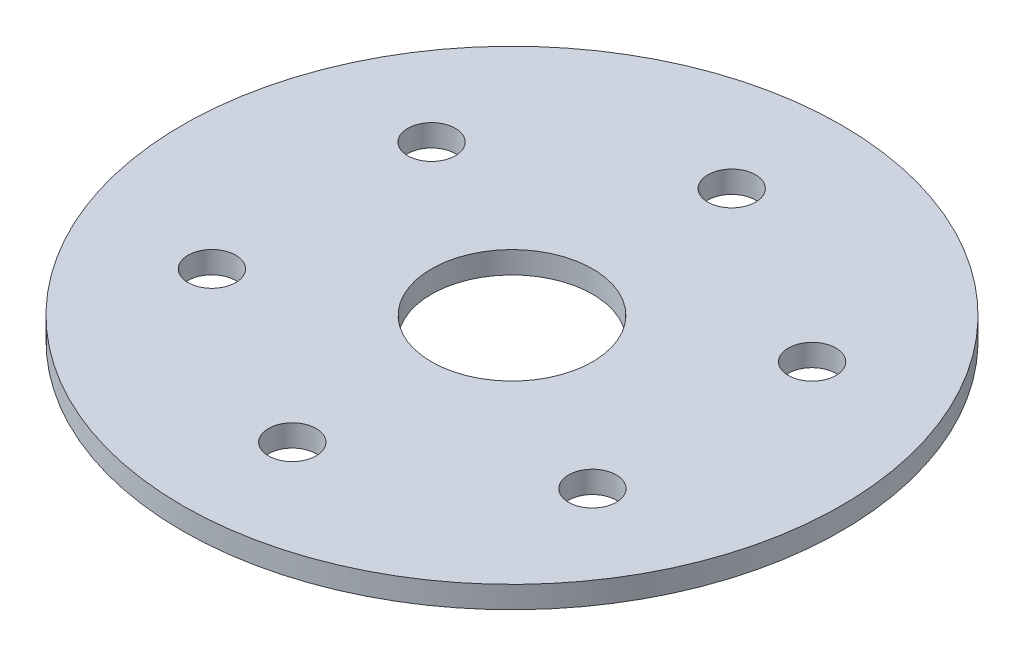
ISO-10303-21;
HEADER;
FILE_DESCRIPTION(('STEP AP214'),'2;1');
FILE_NAME('part.step','',(''),(''),'','','');
FILE_SCHEMA(('AUTOMOTIVE_DESIGN { 1 0 10303 214 1 1 1 1 }'));
ENDSEC;
DATA;
#1=APPLICATION_CONTEXT('core data for automotive mechanical design processes');
#2=APPLICATION_PROTOCOL_DEFINITION('international standard','automotive_design',2000,#1);
#3=PRODUCT_CONTEXT('',#1,'mechanical');
#4=PRODUCT('Part','Part','',(#3));
#5=PRODUCT_RELATED_PRODUCT_CATEGORY('part','',(#4));
#6=PRODUCT_DEFINITION_FORMATION('','',#4);
#7=PRODUCT_DEFINITION_CONTEXT('part definition',#1,'design');
#8=PRODUCT_DEFINITION('design','',#6,#7);
#9=PRODUCT_DEFINITION_SHAPE('','',#8);
#10=(LENGTH_UNIT() NAMED_UNIT(*) SI_UNIT(.MILLI.,.METRE.));
#11=(NAMED_UNIT(*) PLANE_ANGLE_UNIT() SI_UNIT($,.RADIAN.));
#12=(NAMED_UNIT(*) SI_UNIT($,.STERADIAN.) SOLID_ANGLE_UNIT());
#13=UNCERTAINTY_MEASURE_WITH_UNIT(LENGTH_MEASURE(1.E-05),#10,'distance_accuracy_value','');
#14=(GEOMETRIC_REPRESENTATION_CONTEXT(3) GLOBAL_UNCERTAINTY_ASSIGNED_CONTEXT((#13)) GLOBAL_UNIT_ASSIGNED_CONTEXT((#10,
#11,#12)) REPRESENTATION_CONTEXT('',''));
#15=CARTESIAN_POINT('',(0.,0.,0.));
#16=DIRECTION('',(0.,0.,1.));
#17=DIRECTION('',(1.,0.,0.));
#18=AXIS2_PLACEMENT_3D('',#15,#16,#17);
#19=CARTESIAN_POINT('',(0.,3.,0.));
#20=DIRECTION('',(0.,1.,0.));
#21=DIRECTION('',(0.,0.,1.));
#22=AXIS2_PLACEMENT_3D('',#19,#20,#21);
#23=PLANE('',#22);
#24=CARTESIAN_POINT('',(-25.9807621135298,3.,-14.9999999999941));
#25=DIRECTION('',(0.,1.,0.));
#26=DIRECTION('',(0.,0.,1.));
#27=AXIS2_PLACEMENT_3D('',#24,#25,#26);
#28=CIRCLE('',#27,3.25);
#29=CARTESIAN_POINT('',(-25.9807621135298,3.,-11.7499999999941));
#30=VERTEX_POINT('',#29);
#31=EDGE_CURVE('E79',#30,#30,#28,.T.);
#32=ORIENTED_EDGE('',*,*,#31,.F.);
#33=EDGE_LOOP('',(#32));
#34=FACE_BOUND('',#33,.T.);
#35=CARTESIAN_POINT('',(-25.9807621135229,3.,15.0000000000059));
#36=DIRECTION('',(0.,1.,0.));
#37=DIRECTION('',(0.,0.,1.));
#38=AXIS2_PLACEMENT_3D('',#35,#36,#37);
#39=CIRCLE('',#38,3.25);
#40=CARTESIAN_POINT('',(-25.9807621135229,3.,18.2500000000059));
#41=VERTEX_POINT('',#40);
#42=EDGE_CURVE('E73',#41,#41,#39,.T.);
#43=ORIENTED_EDGE('',*,*,#42,.F.);
#44=EDGE_LOOP('',(#43));
#45=FACE_BOUND('',#44,.T.);
#46=CARTESIAN_POINT('',(1.36020071822221E-11,3.,30.));
#47=DIRECTION('',(0.,1.,0.));
#48=DIRECTION('',(0.,0.,1.));
#49=AXIS2_PLACEMENT_3D('',#46,#47,#48);
#50=CIRCLE('',#49,3.25);
#51=CARTESIAN_POINT('',(1.36020071822221E-11,3.,33.25));
#52=VERTEX_POINT('',#51);
#53=EDGE_CURVE('E67',#52,#52,#50,.T.);
#54=ORIENTED_EDGE('',*,*,#53,.F.);
#55=EDGE_LOOP('',(#54));
#56=FACE_BOUND('',#55,.T.);
#57=CARTESIAN_POINT('',(25.9807621135434,3.,14.9999999999941));
#58=DIRECTION('',(0.,1.,0.));
#59=DIRECTION('',(0.,0.,1.));
#60=AXIS2_PLACEMENT_3D('',#57,#58,#59);
#61=CIRCLE('',#60,3.25);
#62=CARTESIAN_POINT('',(25.9807621135434,3.,18.2499999999941));
#63=VERTEX_POINT('',#62);
#64=EDGE_CURVE('E61',#63,#63,#61,.T.);
#65=ORIENTED_EDGE('',*,*,#64,.F.);
#66=EDGE_LOOP('',(#65));
#67=FACE_BOUND('',#66,.T.);
#68=CARTESIAN_POINT('',(25.9807621135365,3.,-15.0000000000059));
#69=DIRECTION('',(0.,1.,0.));
#70=DIRECTION('',(0.,0.,1.));
#71=AXIS2_PLACEMENT_3D('',#68,#69,#70);
#72=CIRCLE('',#71,3.25);
#73=CARTESIAN_POINT('',(25.9807621135365,3.,-11.7500000000059));
#74=VERTEX_POINT('',#73);
#75=EDGE_CURVE('E55',#74,#74,#72,.T.);
#76=ORIENTED_EDGE('',*,*,#75,.F.);
#77=EDGE_LOOP('',(#76));
#78=FACE_BOUND('',#77,.T.);
#79=CARTESIAN_POINT('',(0.,3.,-30.));
#80=DIRECTION('',(0.,1.,0.));
#81=DIRECTION('',(0.,0.,1.));
#82=AXIS2_PLACEMENT_3D('',#79,#80,#81);
#83=CIRCLE('',#82,3.25);
#84=CARTESIAN_POINT('',(0.,3.,-26.75));
#85=VERTEX_POINT('',#84);
#86=EDGE_CURVE('E49',#85,#85,#83,.T.);
#87=ORIENTED_EDGE('',*,*,#86,.F.);
#88=EDGE_LOOP('',(#87));
#89=FACE_BOUND('',#88,.T.);
#90=CARTESIAN_POINT('',(0.,3.,0.));
#91=DIRECTION('',(0.,1.,0.));
#92=DIRECTION('',(0.,0.,1.));
#93=AXIS2_PLACEMENT_3D('',#90,#91,#92);
#94=CIRCLE('',#93,45.);
#95=CARTESIAN_POINT('',(0.,3.,45.));
#96=VERTEX_POINT('',#95);
#97=EDGE_CURVE('E10',#96,#96,#94,.T.);
#98=ORIENTED_EDGE('',*,*,#97,.T.);
#99=EDGE_LOOP('',(#98));
#100=FACE_BOUND('',#99,.T.);
#101=CARTESIAN_POINT('',(0.,3.,0.));
#102=DIRECTION('',(0.,1.,0.));
#103=DIRECTION('',(0.,0.,1.));
#104=AXIS2_PLACEMENT_3D('',#101,#102,#103);
#105=CIRCLE('',#104,11.);
#106=CARTESIAN_POINT('',(0.,3.,11.));
#107=VERTEX_POINT('',#106);
#108=EDGE_CURVE('E41',#107,#107,#105,.T.);
#109=ORIENTED_EDGE('',*,*,#108,.F.);
#110=EDGE_LOOP('',(#109));
#111=FACE_BOUND('',#110,.T.);
#112=ADVANCED_FACE('F30',(#34,#45,#56,#67,#78,#89,#100,#111),#23,.T.);
#113=CARTESIAN_POINT('',(0.,0.,0.));
#114=DIRECTION('',(0.,1.,0.));
#115=DIRECTION('',(0.,0.,1.));
#116=AXIS2_PLACEMENT_3D('',#113,#114,#115);
#117=PLANE('',#116);
#118=CARTESIAN_POINT('',(-25.9807621135298,0.,-14.9999999999941));
#119=DIRECTION('',(0.,1.,0.));
#120=DIRECTION('',(0.,0.,1.));
#121=AXIS2_PLACEMENT_3D('',#118,#119,#120);
#122=CIRCLE('',#121,3.25);
#123=CARTESIAN_POINT('',(-25.9807621135298,0.,-11.7499999999941));
#124=VERTEX_POINT('',#123);
#125=EDGE_CURVE('E76',#124,#124,#122,.T.);
#126=ORIENTED_EDGE('',*,*,#125,.T.);
#127=EDGE_LOOP('',(#126));
#128=FACE_BOUND('',#127,.T.);
#129=CARTESIAN_POINT('',(-25.9807621135229,0.,15.0000000000059));
#130=DIRECTION('',(0.,1.,0.));
#131=DIRECTION('',(0.,0.,1.));
#132=AXIS2_PLACEMENT_3D('',#129,#130,#131);
#133=CIRCLE('',#132,3.25);
#134=CARTESIAN_POINT('',(-25.9807621135229,0.,18.2500000000059));
#135=VERTEX_POINT('',#134);
#136=EDGE_CURVE('E70',#135,#135,#133,.T.);
#137=ORIENTED_EDGE('',*,*,#136,.T.);
#138=EDGE_LOOP('',(#137));
#139=FACE_BOUND('',#138,.T.);
#140=CARTESIAN_POINT('',(1.36020071822221E-11,0.,30.));
#141=DIRECTION('',(0.,1.,0.));
#142=DIRECTION('',(0.,0.,1.));
#143=AXIS2_PLACEMENT_3D('',#140,#141,#142);
#144=CIRCLE('',#143,3.25);
#145=CARTESIAN_POINT('',(1.36020071822221E-11,0.,33.25));
#146=VERTEX_POINT('',#145);
#147=EDGE_CURVE('E64',#146,#146,#144,.T.);
#148=ORIENTED_EDGE('',*,*,#147,.T.);
#149=EDGE_LOOP('',(#148));
#150=FACE_BOUND('',#149,.T.);
#151=CARTESIAN_POINT('',(25.9807621135434,0.,14.9999999999941));
#152=DIRECTION('',(0.,1.,0.));
#153=DIRECTION('',(0.,0.,1.));
#154=AXIS2_PLACEMENT_3D('',#151,#152,#153);
#155=CIRCLE('',#154,3.25);
#156=CARTESIAN_POINT('',(25.9807621135434,0.,18.2499999999941));
#157=VERTEX_POINT('',#156);
#158=EDGE_CURVE('E58',#157,#157,#155,.T.);
#159=ORIENTED_EDGE('',*,*,#158,.T.);
#160=EDGE_LOOP('',(#159));
#161=FACE_BOUND('',#160,.T.);
#162=CARTESIAN_POINT('',(25.9807621135365,0.,-15.0000000000059));
#163=DIRECTION('',(0.,1.,0.));
#164=DIRECTION('',(0.,0.,1.));
#165=AXIS2_PLACEMENT_3D('',#162,#163,#164);
#166=CIRCLE('',#165,3.25);
#167=CARTESIAN_POINT('',(25.9807621135365,0.,-11.7500000000059));
#168=VERTEX_POINT('',#167);
#169=EDGE_CURVE('E52',#168,#168,#166,.T.);
#170=ORIENTED_EDGE('',*,*,#169,.T.);
#171=EDGE_LOOP('',(#170));
#172=FACE_BOUND('',#171,.T.);
#173=CARTESIAN_POINT('',(0.,0.,-30.));
#174=DIRECTION('',(0.,1.,0.));
#175=DIRECTION('',(0.,0.,1.));
#176=AXIS2_PLACEMENT_3D('',#173,#174,#175);
#177=CIRCLE('',#176,3.25);
#178=CARTESIAN_POINT('',(0.,0.,-26.75));
#179=VERTEX_POINT('',#178);
#180=EDGE_CURVE('E46',#179,#179,#177,.T.);
#181=ORIENTED_EDGE('',*,*,#180,.T.);
#182=EDGE_LOOP('',(#181));
#183=FACE_BOUND('',#182,.T.);
#184=CARTESIAN_POINT('',(0.,0.,0.));
#185=DIRECTION('',(0.,1.,0.));
#186=DIRECTION('',(0.,0.,1.));
#187=AXIS2_PLACEMENT_3D('',#184,#185,#186);
#188=CIRCLE('',#187,45.);
#189=CARTESIAN_POINT('',(0.,0.,45.));
#190=VERTEX_POINT('',#189);
#191=EDGE_CURVE('E34',#190,#190,#188,.T.);
#192=ORIENTED_EDGE('',*,*,#191,.F.);
#193=EDGE_LOOP('',(#192));
#194=FACE_BOUND('',#193,.T.);
#195=CARTESIAN_POINT('',(0.,0.,0.));
#196=DIRECTION('',(0.,1.,0.));
#197=DIRECTION('',(0.,0.,1.));
#198=AXIS2_PLACEMENT_3D('',#195,#196,#197);
#199=CIRCLE('',#198,11.);
#200=CARTESIAN_POINT('',(0.,0.,11.));
#201=VERTEX_POINT('',#200);
#202=EDGE_CURVE('E43',#201,#201,#199,.T.);
#203=ORIENTED_EDGE('',*,*,#202,.T.);
#204=EDGE_LOOP('',(#203));
#205=FACE_BOUND('',#204,.T.);
#206=ADVANCED_FACE('F85',(#128,#139,#150,#161,#172,#183,#194,#205),#117,.F.);
#207=CARTESIAN_POINT('',(0.,3.,0.));
#208=DIRECTION('',(0.,-1.,0.));
#209=DIRECTION('',(0.,0.,-1.));
#210=AXIS2_PLACEMENT_3D('',#207,#208,#209);
#211=CYLINDRICAL_SURFACE('',#210,45.);
#212=ORIENTED_EDGE('',*,*,#97,.F.);
#213=EDGE_LOOP('',(#212));
#214=FACE_BOUND('',#213,.T.);
#215=ORIENTED_EDGE('',*,*,#191,.T.);
#216=EDGE_LOOP('',(#215));
#217=FACE_BOUND('',#216,.T.);
#218=ADVANCED_FACE('F32',(#214,#217),#211,.T.);
#219=CARTESIAN_POINT('',(0.,3.,0.));
#220=DIRECTION('',(0.,-1.,0.));
#221=DIRECTION('',(0.,0.,-1.));
#222=AXIS2_PLACEMENT_3D('',#219,#220,#221);
#223=CYLINDRICAL_SURFACE('',#222,11.);
#224=ORIENTED_EDGE('',*,*,#108,.T.);
#225=EDGE_LOOP('',(#224));
#226=FACE_BOUND('',#225,.T.);
#227=ORIENTED_EDGE('',*,*,#202,.F.);
#228=EDGE_LOOP('',(#227));
#229=FACE_BOUND('',#228,.T.);
#230=ADVANCED_FACE('F110',(#226,#229),#223,.F.);
#231=CARTESIAN_POINT('',(0.,0.,-30.));
#232=DIRECTION('',(0.,1.,0.));
#233=DIRECTION('',(0.,0.,1.));
#234=AXIS2_PLACEMENT_3D('',#231,#232,#233);
#235=CYLINDRICAL_SURFACE('',#234,3.25);
#236=ORIENTED_EDGE('',*,*,#180,.F.);
#237=EDGE_LOOP('',(#236));
#238=FACE_BOUND('',#237,.T.);
#239=ORIENTED_EDGE('',*,*,#86,.T.);
#240=EDGE_LOOP('',(#239));
#241=FACE_BOUND('',#240,.T.);
#242=ADVANCED_FACE('F113',(#238,#241),#235,.F.);
#243=CARTESIAN_POINT('',(25.9807621135365,0.,-15.0000000000059));
#244=DIRECTION('',(0.,1.,0.));
#245=DIRECTION('',(0.,0.,1.));
#246=AXIS2_PLACEMENT_3D('',#243,#244,#245);
#247=CYLINDRICAL_SURFACE('',#246,3.25);
#248=ORIENTED_EDGE('',*,*,#169,.F.);
#249=EDGE_LOOP('',(#248));
#250=FACE_BOUND('',#249,.T.);
#251=ORIENTED_EDGE('',*,*,#75,.T.);
#252=EDGE_LOOP('',(#251));
#253=FACE_BOUND('',#252,.T.);
#254=ADVANCED_FACE('F125',(#250,#253),#247,.F.);
#255=CARTESIAN_POINT('',(25.9807621135434,0.,14.9999999999941));
#256=DIRECTION('',(0.,1.,0.));
#257=DIRECTION('',(0.,0.,1.));
#258=AXIS2_PLACEMENT_3D('',#255,#256,#257);
#259=CYLINDRICAL_SURFACE('',#258,3.25);
#260=ORIENTED_EDGE('',*,*,#158,.F.);
#261=EDGE_LOOP('',(#260));
#262=FACE_BOUND('',#261,.T.);
#263=ORIENTED_EDGE('',*,*,#64,.T.);
#264=EDGE_LOOP('',(#263));
#265=FACE_BOUND('',#264,.T.);
#266=ADVANCED_FACE('F129',(#262,#265),#259,.F.);
#267=CARTESIAN_POINT('',(1.36020071822221E-11,0.,30.));
#268=DIRECTION('',(0.,1.,0.));
#269=DIRECTION('',(0.,0.,1.));
#270=AXIS2_PLACEMENT_3D('',#267,#268,#269);
#271=CYLINDRICAL_SURFACE('',#270,3.25);
#272=ORIENTED_EDGE('',*,*,#147,.F.);
#273=EDGE_LOOP('',(#272));
#274=FACE_BOUND('',#273,.T.);
#275=ORIENTED_EDGE('',*,*,#53,.T.);
#276=EDGE_LOOP('',(#275));
#277=FACE_BOUND('',#276,.T.);
#278=ADVANCED_FACE('F133',(#274,#277),#271,.F.);
#279=CARTESIAN_POINT('',(-25.9807621135229,0.,15.0000000000059));
#280=DIRECTION('',(0.,1.,0.));
#281=DIRECTION('',(0.,0.,1.));
#282=AXIS2_PLACEMENT_3D('',#279,#280,#281);
#283=CYLINDRICAL_SURFACE('',#282,3.25);
#284=ORIENTED_EDGE('',*,*,#136,.F.);
#285=EDGE_LOOP('',(#284));
#286=FACE_BOUND('',#285,.T.);
#287=ORIENTED_EDGE('',*,*,#42,.T.);
#288=EDGE_LOOP('',(#287));
#289=FACE_BOUND('',#288,.T.);
#290=ADVANCED_FACE('F91',(#286,#289),#283,.F.);
#291=CARTESIAN_POINT('',(-25.9807621135298,0.,-14.9999999999941));
#292=DIRECTION('',(0.,1.,0.));
#293=DIRECTION('',(0.,0.,1.));
#294=AXIS2_PLACEMENT_3D('',#291,#292,#293);
#295=CYLINDRICAL_SURFACE('',#294,3.25);
#296=ORIENTED_EDGE('',*,*,#125,.F.);
#297=EDGE_LOOP('',(#296));
#298=FACE_BOUND('',#297,.T.);
#299=ORIENTED_EDGE('',*,*,#31,.T.);
#300=EDGE_LOOP('',(#299));
#301=FACE_BOUND('',#300,.T.);
#302=ADVANCED_FACE('F88',(#298,#301),#295,.F.);
#303=CLOSED_SHELL('',(#112,#206,#218,#230,#242,#254,#266,#278,#290,#302));
#304=MANIFOLD_SOLID_BREP('B2',#303);
#305=ADVANCED_BREP_SHAPE_REPRESENTATION('',(#18,#304),#14);
#306=SHAPE_DEFINITION_REPRESENTATION(#9,#305);
ENDSEC;
END-ISO-10303-21;
